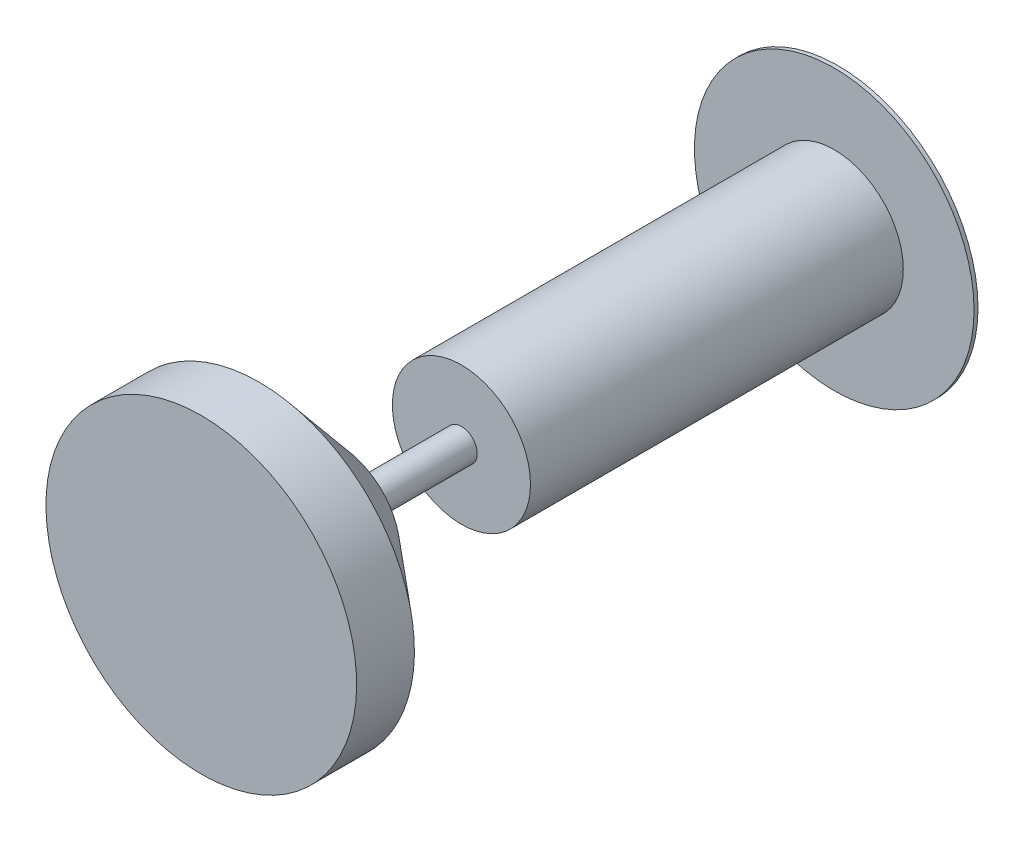
ISO-10303-21;
HEADER;
FILE_DESCRIPTION(('STEP AP214'),'2;1');
FILE_NAME('part.step','',(''),(''),'','','');
FILE_SCHEMA(('AUTOMOTIVE_DESIGN { 1 0 10303 214 1 1 1 1 }'));
ENDSEC;
DATA;
#1=APPLICATION_CONTEXT('core data for automotive mechanical design processes');
#2=APPLICATION_PROTOCOL_DEFINITION('international standard','automotive_design',2000,#1);
#3=PRODUCT_CONTEXT('',#1,'mechanical');
#4=PRODUCT('Part','Part','',(#3));
#5=PRODUCT_RELATED_PRODUCT_CATEGORY('part','',(#4));
#6=PRODUCT_DEFINITION_FORMATION('','',#4);
#7=PRODUCT_DEFINITION_CONTEXT('part definition',#1,'design');
#8=PRODUCT_DEFINITION('design','',#6,#7);
#9=PRODUCT_DEFINITION_SHAPE('','',#8);
#10=(LENGTH_UNIT() NAMED_UNIT(*) SI_UNIT(.MILLI.,.METRE.));
#11=(NAMED_UNIT(*) PLANE_ANGLE_UNIT() SI_UNIT($,.RADIAN.));
#12=(NAMED_UNIT(*) SI_UNIT($,.STERADIAN.) SOLID_ANGLE_UNIT());
#13=UNCERTAINTY_MEASURE_WITH_UNIT(LENGTH_MEASURE(1.E-05),#10,'distance_accuracy_value','');
#14=(GEOMETRIC_REPRESENTATION_CONTEXT(3) GLOBAL_UNCERTAINTY_ASSIGNED_CONTEXT((#13)) GLOBAL_UNIT_ASSIGNED_CONTEXT((#10,
#11,#12)) REPRESENTATION_CONTEXT('',''));
#15=CARTESIAN_POINT('',(0.,0.,0.));
#16=DIRECTION('',(0.,0.,1.));
#17=DIRECTION('',(1.,0.,0.));
#18=AXIS2_PLACEMENT_3D('',#15,#16,#17);
#19=CARTESIAN_POINT('',(0.,0.,-1350.9));
#20=DIRECTION('',(0.,0.,-1.));
#21=DIRECTION('',(-1.,0.,0.));
#22=AXIS2_PLACEMENT_3D('',#19,#20,#21);
#23=CYLINDRICAL_SURFACE('',#22,450.);
#24=CARTESIAN_POINT('',(0.,0.,-1350.9));
#25=DIRECTION('',(0.,0.,1.));
#26=DIRECTION('',(1.,0.,0.));
#27=AXIS2_PLACEMENT_3D('',#24,#25,#26);
#28=CIRCLE('',#27,450.);
#29=CARTESIAN_POINT('',(450.,0.,-1350.9));
#30=VERTEX_POINT('',#29);
#31=EDGE_CURVE('E12',#30,#30,#28,.T.);
#32=ORIENTED_EDGE('',*,*,#31,.F.);
#33=EDGE_LOOP('',(#32));
#34=FACE_BOUND('',#33,.T.);
#35=CARTESIAN_POINT('',(0.,0.,-1363.6));
#36=DIRECTION('',(0.,0.,1.));
#37=DIRECTION('',(1.,0.,0.));
#38=AXIS2_PLACEMENT_3D('',#35,#36,#37);
#39=CIRCLE('',#38,450.);
#40=CARTESIAN_POINT('',(450.,0.,-1363.6));
#41=VERTEX_POINT('',#40);
#42=EDGE_CURVE('E60',#41,#41,#39,.T.);
#43=ORIENTED_EDGE('',*,*,#42,.T.);
#44=EDGE_LOOP('',(#43));
#45=FACE_BOUND('',#44,.T.);
#46=ADVANCED_FACE('F51',(#34,#45),#23,.T.);
#47=CARTESIAN_POINT('',(0.,0.,-1350.9));
#48=DIRECTION('',(0.,0.,1.));
#49=DIRECTION('',(1.,0.,0.));
#50=AXIS2_PLACEMENT_3D('',#47,#48,#49);
#51=PLANE('',#50);
#52=CARTESIAN_POINT('',(0.,0.,-1350.9));
#53=DIRECTION('',(0.,0.,1.));
#54=DIRECTION('',(1.,0.,0.));
#55=AXIS2_PLACEMENT_3D('',#52,#53,#54);
#56=CIRCLE('',#55,222.25);
#57=CARTESIAN_POINT('',(222.25,0.,-1350.9));
#58=VERTEX_POINT('',#57);
#59=EDGE_CURVE('E69',#58,#58,#56,.T.);
#60=ORIENTED_EDGE('',*,*,#59,.F.);
#61=EDGE_LOOP('',(#60));
#62=FACE_BOUND('',#61,.T.);
#63=ORIENTED_EDGE('',*,*,#31,.T.);
#64=EDGE_LOOP('',(#63));
#65=FACE_BOUND('',#64,.T.);
#66=ADVANCED_FACE('F113',(#62,#65),#51,.T.);
#67=CARTESIAN_POINT('',(0.,0.,-1363.6));
#68=DIRECTION('',(0.,0.,1.));
#69=DIRECTION('',(1.,0.,0.));
#70=AXIS2_PLACEMENT_3D('',#67,#68,#69);
#71=PLANE('',#70);
#72=ORIENTED_EDGE('',*,*,#42,.F.);
#73=EDGE_LOOP('',(#72));
#74=FACE_BOUND('',#73,.T.);
#75=ADVANCED_FACE('F119',(#74),#71,.F.);
#76=CARTESIAN_POINT('',(0.,0.,-150.9));
#77=DIRECTION('',(0.,0.,-1.));
#78=DIRECTION('',(-1.,0.,0.));
#79=AXIS2_PLACEMENT_3D('',#76,#77,#78);
#80=CYLINDRICAL_SURFACE('',#79,222.25);
#81=CARTESIAN_POINT('',(0.,0.,-150.9));
#82=DIRECTION('',(0.,0.,1.));
#83=DIRECTION('',(1.,0.,0.));
#84=AXIS2_PLACEMENT_3D('',#81,#82,#83);
#85=CIRCLE('',#84,222.25);
#86=CARTESIAN_POINT('',(222.25,0.,-150.9));
#87=VERTEX_POINT('',#86);
#88=EDGE_CURVE('E73',#87,#87,#85,.T.);
#89=ORIENTED_EDGE('',*,*,#88,.F.);
#90=EDGE_LOOP('',(#89));
#91=FACE_BOUND('',#90,.T.);
#92=ORIENTED_EDGE('',*,*,#59,.T.);
#93=EDGE_LOOP('',(#92));
#94=FACE_BOUND('',#93,.T.);
#95=ADVANCED_FACE('F126',(#91,#94),#80,.T.);
#96=CARTESIAN_POINT('',(0.,0.,-150.9));
#97=DIRECTION('',(0.,0.,1.));
#98=DIRECTION('',(1.,0.,0.));
#99=AXIS2_PLACEMENT_3D('',#96,#97,#98);
#100=PLANE('',#99);
#101=CARTESIAN_POINT('',(0.,0.,-150.9));
#102=DIRECTION('',(0.,0.,1.));
#103=DIRECTION('',(1.,0.,0.));
#104=AXIS2_PLACEMENT_3D('',#101,#102,#103);
#105=CIRCLE('',#104,50.8);
#106=CARTESIAN_POINT('',(50.8,0.,-150.9));
#107=VERTEX_POINT('',#106);
#108=EDGE_CURVE('E66',#107,#107,#105,.T.);
#109=ORIENTED_EDGE('',*,*,#108,.F.);
#110=EDGE_LOOP('',(#109));
#111=FACE_BOUND('',#110,.T.);
#112=ORIENTED_EDGE('',*,*,#88,.T.);
#113=EDGE_LOOP('',(#112));
#114=FACE_BOUND('',#113,.T.);
#115=ADVANCED_FACE('F159',(#111,#114),#100,.T.);
#116=CARTESIAN_POINT('',(0.,0.,686.4));
#117=DIRECTION('',(0.,0.,-1.));
#118=DIRECTION('',(-1.,0.,0.));
#119=AXIS2_PLACEMENT_3D('',#116,#117,#118);
#120=CYLINDRICAL_SURFACE('',#119,50.8);
#121=CARTESIAN_POINT('',(0.,0.,246.4));
#122=DIRECTION('',(0.,0.,-1.));
#123=DIRECTION('',(0.,1.,0.));
#124=AXIS2_PLACEMENT_3D('',#121,#122,#123);
#125=CIRCLE('',#124,50.8);
#126=CARTESIAN_POINT('',(0.,50.8,246.4));
#127=VERTEX_POINT('',#126);
#128=EDGE_CURVE('E55',#127,#127,#125,.T.);
#129=ORIENTED_EDGE('',*,*,#128,.T.);
#130=EDGE_LOOP('',(#129));
#131=FACE_BOUND('',#130,.T.);
#132=ORIENTED_EDGE('',*,*,#108,.T.);
#133=EDGE_LOOP('',(#132));
#134=FACE_BOUND('',#133,.T.);
#135=ADVANCED_FACE('F53',(#131,#134),#120,.T.);
#136=CARTESIAN_POINT('',(0.,0.,246.4));
#137=DIRECTION('',(0.,0.,-1.));
#138=DIRECTION('',(0.,1.,0.));
#139=AXIS2_PLACEMENT_3D('',#136,#137,#138);
#140=CYLINDRICAL_SURFACE('',#139,500.);
#141=CARTESIAN_POINT('',(0.,0.,686.4));
#142=DIRECTION('',(0.,0.,-1.));
#143=DIRECTION('',(0.,1.,0.));
#144=AXIS2_PLACEMENT_3D('',#141,#142,#143);
#145=CIRCLE('',#144,500.);
#146=CARTESIAN_POINT('',(0.,500.,686.4));
#147=VERTEX_POINT('',#146);
#148=EDGE_CURVE('E83',#147,#147,#145,.T.);
#149=ORIENTED_EDGE('',*,*,#148,.T.);
#150=EDGE_LOOP('',(#149));
#151=FACE_BOUND('',#150,.T.);
#152=CARTESIAN_POINT('',(0.,0.,500.4));
#153=DIRECTION('',(0.,0.,-1.));
#154=DIRECTION('',(0.,1.,0.));
#155=AXIS2_PLACEMENT_3D('',#152,#153,#154);
#156=CIRCLE('',#155,500.);
#157=CARTESIAN_POINT('',(0.,500.,500.4));
#158=VERTEX_POINT('',#157);
#159=EDGE_CURVE('E87',#158,#158,#156,.T.);
#160=ORIENTED_EDGE('',*,*,#159,.F.);
#161=EDGE_LOOP('',(#160));
#162=FACE_BOUND('',#161,.T.);
#163=ADVANCED_FACE('F100',(#151,#162),#140,.T.);
#164=CARTESIAN_POINT('',(0.,0.,246.4));
#165=DIRECTION('',(0.,0.,1.));
#166=DIRECTION('',(0.,-1.,0.));
#167=AXIS2_PLACEMENT_3D('',#164,#165,#166);
#168=CONICAL_SURFACE('',#167,200.,0.868240620272372);
#169=ORIENTED_EDGE('',*,*,#159,.T.);
#170=EDGE_LOOP('',(#169));
#171=FACE_BOUND('',#170,.T.);
#172=CARTESIAN_POINT('',(0.,0.,246.4));
#173=DIRECTION('',(0.,0.,-1.));
#174=DIRECTION('',(0.,1.,0.));
#175=AXIS2_PLACEMENT_3D('',#172,#173,#174);
#176=CIRCLE('',#175,200.);
#177=CARTESIAN_POINT('',(0.,200.,246.4));
#178=VERTEX_POINT('',#177);
#179=EDGE_CURVE('E91',#178,#178,#176,.T.);
#180=ORIENTED_EDGE('',*,*,#179,.F.);
#181=EDGE_LOOP('',(#180));
#182=FACE_BOUND('',#181,.T.);
#183=ADVANCED_FACE('F98',(#171,#182),#168,.T.);
#184=CARTESIAN_POINT('',(0.,200.,246.4));
#185=DIRECTION('',(0.,0.,-1.));
#186=DIRECTION('',(0.,1.,0.));
#187=AXIS2_PLACEMENT_3D('',#184,#185,#186);
#188=PLANE('',#187);
#189=ORIENTED_EDGE('',*,*,#128,.F.);
#190=EDGE_LOOP('',(#189));
#191=FACE_BOUND('',#190,.T.);
#192=ORIENTED_EDGE('',*,*,#179,.T.);
#193=EDGE_LOOP('',(#192));
#194=FACE_BOUND('',#193,.T.);
#195=ADVANCED_FACE('F96',(#191,#194),#188,.T.);
#196=CARTESIAN_POINT('',(0.,0.,686.4));
#197=DIRECTION('',(0.,0.,1.));
#198=DIRECTION('',(1.,0.,0.));
#199=AXIS2_PLACEMENT_3D('',#196,#197,#198);
#200=PLANE('',#199);
#201=ORIENTED_EDGE('',*,*,#148,.F.);
#202=EDGE_LOOP('',(#201));
#203=FACE_BOUND('',#202,.T.);
#204=ADVANCED_FACE('F107',(#203),#200,.T.);
#205=CLOSED_SHELL('',(#46,#66,#75,#95,#115,#135,#163,#183,#195,#204));
#206=MANIFOLD_SOLID_BREP('B2',#205);
#207=ADVANCED_BREP_SHAPE_REPRESENTATION('',(#18,#206),#14);
#208=SHAPE_DEFINITION_REPRESENTATION(#9,#207);
ENDSEC;
END-ISO-10303-21;
